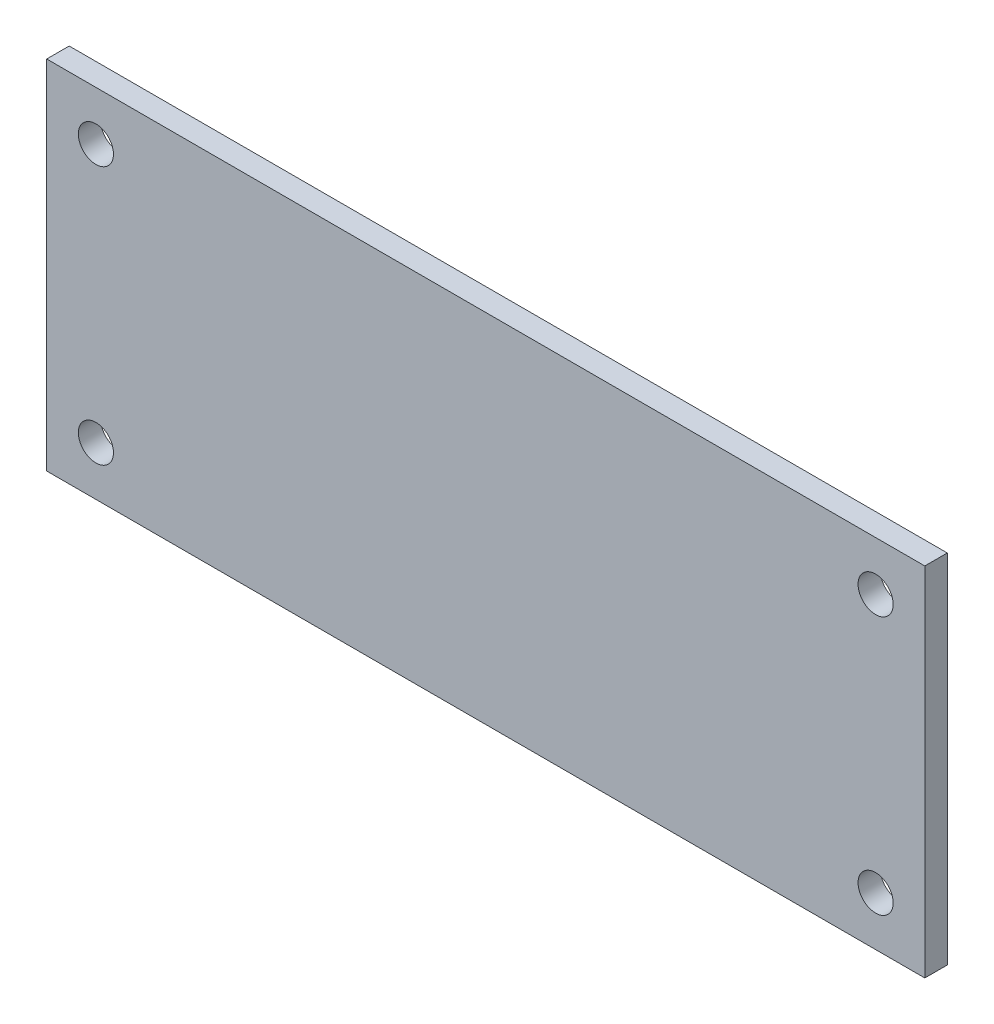
ISO-10303-21;
HEADER;
FILE_DESCRIPTION(('STEP AP214'),'2;1');
FILE_NAME('part.step','',(''),(''),'','','');
FILE_SCHEMA(('AUTOMOTIVE_DESIGN { 1 0 10303 214 1 1 1 1 }'));
ENDSEC;
DATA;
#1=APPLICATION_CONTEXT('core data for automotive mechanical design processes');
#2=APPLICATION_PROTOCOL_DEFINITION('international standard','automotive_design',2000,#1);
#3=PRODUCT_CONTEXT('',#1,'mechanical');
#4=PRODUCT('Part','Part','',(#3));
#5=PRODUCT_RELATED_PRODUCT_CATEGORY('part','',(#4));
#6=PRODUCT_DEFINITION_FORMATION('','',#4);
#7=PRODUCT_DEFINITION_CONTEXT('part definition',#1,'design');
#8=PRODUCT_DEFINITION('design','',#6,#7);
#9=PRODUCT_DEFINITION_SHAPE('','',#8);
#10=(LENGTH_UNIT() NAMED_UNIT(*) SI_UNIT(.MILLI.,.METRE.));
#11=(NAMED_UNIT(*) PLANE_ANGLE_UNIT() SI_UNIT($,.RADIAN.));
#12=(NAMED_UNIT(*) SI_UNIT($,.STERADIAN.) SOLID_ANGLE_UNIT());
#13=UNCERTAINTY_MEASURE_WITH_UNIT(LENGTH_MEASURE(1.E-05),#10,'distance_accuracy_value','');
#14=(GEOMETRIC_REPRESENTATION_CONTEXT(3) GLOBAL_UNCERTAINTY_ASSIGNED_CONTEXT((#13)) GLOBAL_UNIT_ASSIGNED_CONTEXT((#10,
#11,#12)) REPRESENTATION_CONTEXT('',''));
#15=CARTESIAN_POINT('',(0.,0.,0.));
#16=DIRECTION('',(0.,0.,1.));
#17=DIRECTION('',(1.,0.,0.));
#18=AXIS2_PLACEMENT_3D('',#15,#16,#17);
#19=CARTESIAN_POINT('',(0.,0.,1.6));
#20=DIRECTION('',(0.,0.,-1.));
#21=DIRECTION('',(-1.,0.,0.));
#22=AXIS2_PLACEMENT_3D('',#19,#20,#21);
#23=PLANE('',#22);
#24=DIRECTION('',(0.,1.,0.));
#25=VECTOR('',#24,1.);
#26=CARTESIAN_POINT('',(31.25,-12.7,1.6));
#27=LINE('',#26,#25);
#28=CARTESIAN_POINT('',(31.25,-12.7,1.6));
#29=VERTEX_POINT('',#28);
#30=CARTESIAN_POINT('',(31.25,12.7,1.6));
#31=VERTEX_POINT('',#30);
#32=EDGE_CURVE('E85',#29,#31,#27,.T.);
#33=ORIENTED_EDGE('',*,*,#32,.T.);
#34=DIRECTION('',(-1.,0.,0.));
#35=VECTOR('',#34,1.);
#36=CARTESIAN_POINT('',(-31.25,12.7,1.6));
#37=LINE('',#36,#35);
#38=CARTESIAN_POINT('',(-31.25,12.7,1.6));
#39=VERTEX_POINT('',#38);
#40=EDGE_CURVE('E80',#31,#39,#37,.T.);
#41=ORIENTED_EDGE('',*,*,#40,.T.);
#42=DIRECTION('',(0.,-1.,0.));
#43=VECTOR('',#42,1.);
#44=CARTESIAN_POINT('',(-31.25,-12.7,1.6));
#45=LINE('',#44,#43);
#46=CARTESIAN_POINT('',(-31.25,-12.7,1.6));
#47=VERTEX_POINT('',#46);
#48=EDGE_CURVE('E83',#39,#47,#45,.T.);
#49=ORIENTED_EDGE('',*,*,#48,.T.);
#50=DIRECTION('',(1.,0.,0.));
#51=VECTOR('',#50,1.);
#52=CARTESIAN_POINT('',(-31.25,-12.7,1.6));
#53=LINE('',#52,#51);
#54=EDGE_CURVE('E50',#47,#29,#53,.T.);
#55=ORIENTED_EDGE('',*,*,#54,.T.);
#56=EDGE_LOOP('',(#33,#41,#49,#55));
#57=FACE_BOUND('',#56,.T.);
#58=CARTESIAN_POINT('',(-27.75,9.2,1.6));
#59=DIRECTION('',(0.,0.,1.));
#60=DIRECTION('',(1.,0.,0.));
#61=AXIS2_PLACEMENT_3D('',#58,#59,#60);
#62=CIRCLE('',#61,1.25);
#63=CARTESIAN_POINT('',(-26.5,9.2,1.6));
#64=VERTEX_POINT('',#63);
#65=EDGE_CURVE('E100',#64,#64,#62,.T.);
#66=ORIENTED_EDGE('',*,*,#65,.F.);
#67=EDGE_LOOP('',(#66));
#68=FACE_BOUND('',#67,.T.);
#69=CARTESIAN_POINT('',(27.75,9.2,1.6));
#70=DIRECTION('',(0.,0.,1.));
#71=DIRECTION('',(1.,0.,0.));
#72=AXIS2_PLACEMENT_3D('',#69,#70,#71);
#73=CIRCLE('',#72,1.25);
#74=CARTESIAN_POINT('',(29.,9.2,1.6));
#75=VERTEX_POINT('',#74);
#76=EDGE_CURVE('E115',#75,#75,#73,.T.);
#77=ORIENTED_EDGE('',*,*,#76,.F.);
#78=EDGE_LOOP('',(#77));
#79=FACE_BOUND('',#78,.T.);
#80=CARTESIAN_POINT('',(27.75,-9.2,1.6));
#81=DIRECTION('',(0.,0.,1.));
#82=DIRECTION('',(1.,0.,0.));
#83=AXIS2_PLACEMENT_3D('',#80,#81,#82);
#84=CIRCLE('',#83,1.25);
#85=CARTESIAN_POINT('',(29.,-9.2,1.6));
#86=VERTEX_POINT('',#85);
#87=EDGE_CURVE('E121',#86,#86,#84,.T.);
#88=ORIENTED_EDGE('',*,*,#87,.F.);
#89=EDGE_LOOP('',(#88));
#90=FACE_BOUND('',#89,.T.);
#91=CARTESIAN_POINT('',(-27.75,-9.2,1.6));
#92=DIRECTION('',(0.,0.,1.));
#93=DIRECTION('',(1.,0.,0.));
#94=AXIS2_PLACEMENT_3D('',#91,#92,#93);
#95=CIRCLE('',#94,1.25);
#96=CARTESIAN_POINT('',(-26.5,-9.2,1.6));
#97=VERTEX_POINT('',#96);
#98=EDGE_CURVE('E127',#97,#97,#95,.T.);
#99=ORIENTED_EDGE('',*,*,#98,.F.);
#100=EDGE_LOOP('',(#99));
#101=FACE_BOUND('',#100,.T.);
#102=ADVANCED_FACE('F33',(#57,#68,#79,#90,#101),#23,.F.);
#103=CARTESIAN_POINT('',(0.,0.,0.));
#104=DIRECTION('',(0.,0.,-1.));
#105=DIRECTION('',(-1.,0.,0.));
#106=AXIS2_PLACEMENT_3D('',#103,#104,#105);
#107=PLANE('',#106);
#108=CARTESIAN_POINT('',(27.75,-9.2,0.));
#109=DIRECTION('',(0.,0.,1.));
#110=DIRECTION('',(1.,0.,0.));
#111=AXIS2_PLACEMENT_3D('',#108,#109,#110);
#112=CIRCLE('',#111,1.25);
#113=CARTESIAN_POINT('',(29.,-9.2,0.));
#114=VERTEX_POINT('',#113);
#115=EDGE_CURVE('E124',#114,#114,#112,.T.);
#116=ORIENTED_EDGE('',*,*,#115,.T.);
#117=EDGE_LOOP('',(#116));
#118=FACE_BOUND('',#117,.T.);
#119=CARTESIAN_POINT('',(-27.75,9.2,0.));
#120=DIRECTION('',(0.,0.,1.));
#121=DIRECTION('',(1.,0.,0.));
#122=AXIS2_PLACEMENT_3D('',#119,#120,#121);
#123=CIRCLE('',#122,1.25);
#124=CARTESIAN_POINT('',(-26.5,9.2,0.));
#125=VERTEX_POINT('',#124);
#126=EDGE_CURVE('E112',#125,#125,#123,.T.);
#127=ORIENTED_EDGE('',*,*,#126,.T.);
#128=EDGE_LOOP('',(#127));
#129=FACE_BOUND('',#128,.T.);
#130=DIRECTION('',(0.,1.,0.));
#131=VECTOR('',#130,1.);
#132=CARTESIAN_POINT('',(31.25,-12.7,0.));
#133=LINE('',#132,#131);
#134=CARTESIAN_POINT('',(31.25,-12.7,0.));
#135=VERTEX_POINT('',#134);
#136=CARTESIAN_POINT('',(31.25,12.7,0.));
#137=VERTEX_POINT('',#136);
#138=EDGE_CURVE('E97',#135,#137,#133,.T.);
#139=ORIENTED_EDGE('',*,*,#138,.F.);
#140=DIRECTION('',(1.,0.,0.));
#141=VECTOR('',#140,1.);
#142=CARTESIAN_POINT('',(-31.25,-12.7,0.));
#143=LINE('',#142,#141);
#144=CARTESIAN_POINT('',(-31.25,-12.7,0.));
#145=VERTEX_POINT('',#144);
#146=EDGE_CURVE('E73',#145,#135,#143,.T.);
#147=ORIENTED_EDGE('',*,*,#146,.F.);
#148=DIRECTION('',(0.,-1.,0.));
#149=VECTOR('',#148,1.);
#150=CARTESIAN_POINT('',(-31.25,-12.7,0.));
#151=LINE('',#150,#149);
#152=CARTESIAN_POINT('',(-31.25,12.7,0.));
#153=VERTEX_POINT('',#152);
#154=EDGE_CURVE('E67',#153,#145,#151,.T.);
#155=ORIENTED_EDGE('',*,*,#154,.F.);
#156=DIRECTION('',(-1.,0.,0.));
#157=VECTOR('',#156,1.);
#158=CARTESIAN_POINT('',(-31.25,12.7,0.));
#159=LINE('',#158,#157);
#160=EDGE_CURVE('E89',#137,#153,#159,.T.);
#161=ORIENTED_EDGE('',*,*,#160,.F.);
#162=EDGE_LOOP('',(#139,#147,#155,#161));
#163=FACE_BOUND('',#162,.T.);
#164=CARTESIAN_POINT('',(27.75,9.2,0.));
#165=DIRECTION('',(0.,0.,1.));
#166=DIRECTION('',(1.,0.,0.));
#167=AXIS2_PLACEMENT_3D('',#164,#165,#166);
#168=CIRCLE('',#167,1.25);
#169=CARTESIAN_POINT('',(29.,9.2,0.));
#170=VERTEX_POINT('',#169);
#171=EDGE_CURVE('E118',#170,#170,#168,.T.);
#172=ORIENTED_EDGE('',*,*,#171,.T.);
#173=EDGE_LOOP('',(#172));
#174=FACE_BOUND('',#173,.T.);
#175=CARTESIAN_POINT('',(-27.75,-9.2,0.));
#176=DIRECTION('',(0.,0.,1.));
#177=DIRECTION('',(1.,0.,0.));
#178=AXIS2_PLACEMENT_3D('',#175,#176,#177);
#179=CIRCLE('',#178,1.25);
#180=CARTESIAN_POINT('',(-26.5,-9.2,0.));
#181=VERTEX_POINT('',#180);
#182=EDGE_CURVE('E130',#181,#181,#179,.T.);
#183=ORIENTED_EDGE('',*,*,#182,.T.);
#184=EDGE_LOOP('',(#183));
#185=FACE_BOUND('',#184,.T.);
#186=ADVANCED_FACE('F108',(#118,#129,#163,#174,#185),#107,.T.);
#187=CARTESIAN_POINT('',(31.25,-12.7,1.6));
#188=DIRECTION('',(-1.,0.,0.));
#189=DIRECTION('',(0.,0.,1.));
#190=AXIS2_PLACEMENT_3D('',#187,#188,#189);
#191=PLANE('',#190);
#192=ORIENTED_EDGE('',*,*,#138,.T.);
#193=DIRECTION('',(0.,0.,-1.));
#194=VECTOR('',#193,1.);
#195=CARTESIAN_POINT('',(31.25,12.7,1.6));
#196=LINE('',#195,#194);
#197=EDGE_CURVE('E11',#31,#137,#196,.T.);
#198=ORIENTED_EDGE('',*,*,#197,.F.);
#199=ORIENTED_EDGE('',*,*,#32,.F.);
#200=DIRECTION('',(0.,0.,-1.));
#201=VECTOR('',#200,1.);
#202=CARTESIAN_POINT('',(31.25,-12.7,1.6));
#203=LINE('',#202,#201);
#204=EDGE_CURVE('E93',#29,#135,#203,.T.);
#205=ORIENTED_EDGE('',*,*,#204,.T.);
#206=EDGE_LOOP('',(#192,#198,#199,#205));
#207=FACE_BOUND('',#206,.T.);
#208=ADVANCED_FACE('F35',(#207),#191,.F.);
#209=CARTESIAN_POINT('',(-31.25,12.7,1.6));
#210=DIRECTION('',(0.,-1.,0.));
#211=DIRECTION('',(0.,0.,-1.));
#212=AXIS2_PLACEMENT_3D('',#209,#210,#211);
#213=PLANE('',#212);
#214=ORIENTED_EDGE('',*,*,#160,.T.);
#215=DIRECTION('',(0.,0.,-1.));
#216=VECTOR('',#215,1.);
#217=CARTESIAN_POINT('',(-31.25,12.7,1.6));
#218=LINE('',#217,#216);
#219=EDGE_CURVE('E42',#39,#153,#218,.T.);
#220=ORIENTED_EDGE('',*,*,#219,.F.);
#221=ORIENTED_EDGE('',*,*,#40,.F.);
#222=ORIENTED_EDGE('',*,*,#197,.T.);
#223=EDGE_LOOP('',(#214,#220,#221,#222));
#224=FACE_BOUND('',#223,.T.);
#225=ADVANCED_FACE('F88',(#224),#213,.F.);
#226=CARTESIAN_POINT('',(-31.25,-12.7,1.6));
#227=DIRECTION('',(1.,0.,0.));
#228=DIRECTION('',(0.,0.,-1.));
#229=AXIS2_PLACEMENT_3D('',#226,#227,#228);
#230=PLANE('',#229);
#231=ORIENTED_EDGE('',*,*,#154,.T.);
#232=DIRECTION('',(0.,0.,-1.));
#233=VECTOR('',#232,1.);
#234=CARTESIAN_POINT('',(-31.25,-12.7,1.6));
#235=LINE('',#234,#233);
#236=EDGE_CURVE('E90',#47,#145,#235,.T.);
#237=ORIENTED_EDGE('',*,*,#236,.F.);
#238=ORIENTED_EDGE('',*,*,#48,.F.);
#239=ORIENTED_EDGE('',*,*,#219,.T.);
#240=EDGE_LOOP('',(#231,#237,#238,#239));
#241=FACE_BOUND('',#240,.T.);
#242=ADVANCED_FACE('F91',(#241),#230,.F.);
#243=CARTESIAN_POINT('',(-31.25,-12.7,1.6));
#244=DIRECTION('',(0.,1.,0.));
#245=DIRECTION('',(0.,0.,1.));
#246=AXIS2_PLACEMENT_3D('',#243,#244,#245);
#247=PLANE('',#246);
#248=ORIENTED_EDGE('',*,*,#146,.T.);
#249=ORIENTED_EDGE('',*,*,#204,.F.);
#250=ORIENTED_EDGE('',*,*,#54,.F.);
#251=ORIENTED_EDGE('',*,*,#236,.T.);
#252=EDGE_LOOP('',(#248,#249,#250,#251));
#253=FACE_BOUND('',#252,.T.);
#254=ADVANCED_FACE('F105',(#253),#247,.F.);
#255=CARTESIAN_POINT('',(-27.75,9.2,1.6));
#256=DIRECTION('',(0.,0.,-1.));
#257=DIRECTION('',(-1.,0.,0.));
#258=AXIS2_PLACEMENT_3D('',#255,#256,#257);
#259=CYLINDRICAL_SURFACE('',#258,1.25);
#260=ORIENTED_EDGE('',*,*,#65,.T.);
#261=EDGE_LOOP('',(#260));
#262=FACE_BOUND('',#261,.T.);
#263=ORIENTED_EDGE('',*,*,#126,.F.);
#264=EDGE_LOOP('',(#263));
#265=FACE_BOUND('',#264,.T.);
#266=ADVANCED_FACE('F147',(#262,#265),#259,.F.);
#267=CARTESIAN_POINT('',(27.75,9.2,1.6));
#268=DIRECTION('',(0.,0.,-1.));
#269=DIRECTION('',(-1.,0.,0.));
#270=AXIS2_PLACEMENT_3D('',#267,#268,#269);
#271=CYLINDRICAL_SURFACE('',#270,1.25);
#272=ORIENTED_EDGE('',*,*,#76,.T.);
#273=EDGE_LOOP('',(#272));
#274=FACE_BOUND('',#273,.T.);
#275=ORIENTED_EDGE('',*,*,#171,.F.);
#276=EDGE_LOOP('',(#275));
#277=FACE_BOUND('',#276,.T.);
#278=ADVANCED_FACE('F193',(#274,#277),#271,.F.);
#279=CARTESIAN_POINT('',(27.75,-9.2,1.6));
#280=DIRECTION('',(0.,0.,-1.));
#281=DIRECTION('',(-1.,0.,0.));
#282=AXIS2_PLACEMENT_3D('',#279,#280,#281);
#283=CYLINDRICAL_SURFACE('',#282,1.25);
#284=ORIENTED_EDGE('',*,*,#87,.T.);
#285=EDGE_LOOP('',(#284));
#286=FACE_BOUND('',#285,.T.);
#287=ORIENTED_EDGE('',*,*,#115,.F.);
#288=EDGE_LOOP('',(#287));
#289=FACE_BOUND('',#288,.T.);
#290=ADVANCED_FACE('F201',(#286,#289),#283,.F.);
#291=CARTESIAN_POINT('',(-27.75,-9.2,1.6));
#292=DIRECTION('',(0.,0.,-1.));
#293=DIRECTION('',(-1.,0.,0.));
#294=AXIS2_PLACEMENT_3D('',#291,#292,#293);
#295=CYLINDRICAL_SURFACE('',#294,1.25);
#296=ORIENTED_EDGE('',*,*,#98,.T.);
#297=EDGE_LOOP('',(#296));
#298=FACE_BOUND('',#297,.T.);
#299=ORIENTED_EDGE('',*,*,#182,.F.);
#300=EDGE_LOOP('',(#299));
#301=FACE_BOUND('',#300,.T.);
#302=ADVANCED_FACE('F136',(#298,#301),#295,.F.);
#303=CLOSED_SHELL('',(#102,#186,#208,#225,#242,#254,#266,#278,#290,#302));
#304=MANIFOLD_SOLID_BREP('B2',#303);
#305=ADVANCED_BREP_SHAPE_REPRESENTATION('',(#18,#304),#14);
#306=SHAPE_DEFINITION_REPRESENTATION(#9,#305);
ENDSEC;
END-ISO-10303-21;
